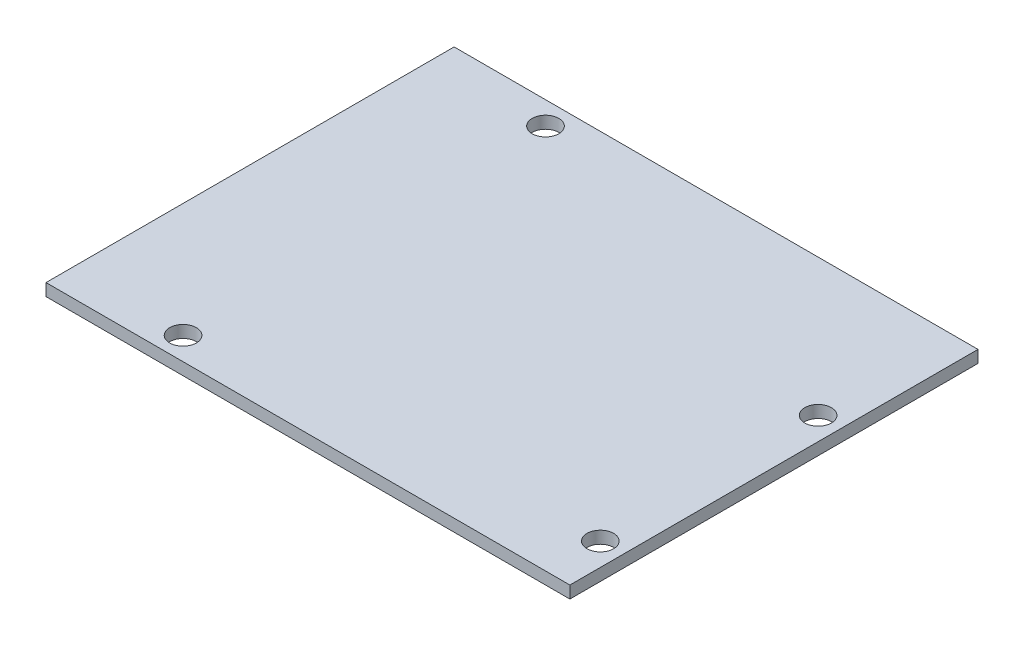
ISO-10303-21;
HEADER;
FILE_DESCRIPTION(('STEP AP214'),'2;1');
FILE_NAME('part.step','',(''),(''),'','','');
FILE_SCHEMA(('AUTOMOTIVE_DESIGN { 1 0 10303 214 1 1 1 1 }'));
ENDSEC;
DATA;
#1=APPLICATION_CONTEXT('core data for automotive mechanical design processes');
#2=APPLICATION_PROTOCOL_DEFINITION('international standard','automotive_design',2000,#1);
#3=PRODUCT_CONTEXT('',#1,'mechanical');
#4=PRODUCT('Part','Part','',(#3));
#5=PRODUCT_RELATED_PRODUCT_CATEGORY('part','',(#4));
#6=PRODUCT_DEFINITION_FORMATION('','',#4);
#7=PRODUCT_DEFINITION_CONTEXT('part definition',#1,'design');
#8=PRODUCT_DEFINITION('design','',#6,#7);
#9=PRODUCT_DEFINITION_SHAPE('','',#8);
#10=(LENGTH_UNIT() NAMED_UNIT(*) SI_UNIT(.MILLI.,.METRE.));
#11=(NAMED_UNIT(*) PLANE_ANGLE_UNIT() SI_UNIT($,.RADIAN.));
#12=(NAMED_UNIT(*) SI_UNIT($,.STERADIAN.) SOLID_ANGLE_UNIT());
#13=UNCERTAINTY_MEASURE_WITH_UNIT(LENGTH_MEASURE(1.E-05),#10,'distance_accuracy_value','');
#14=(GEOMETRIC_REPRESENTATION_CONTEXT(3) GLOBAL_UNCERTAINTY_ASSIGNED_CONTEXT((#13)) GLOBAL_UNIT_ASSIGNED_CONTEXT((#10,
#11,#12)) REPRESENTATION_CONTEXT('',''));
#15=CARTESIAN_POINT('',(0.,0.,0.));
#16=DIRECTION('',(0.,0.,1.));
#17=DIRECTION('',(1.,0.,0.));
#18=AXIS2_PLACEMENT_3D('',#15,#16,#17);
#19=CARTESIAN_POINT('',(-34.4,1.6,26.8));
#20=DIRECTION('',(1.,0.,0.));
#21=DIRECTION('',(0.,0.,-1.));
#22=AXIS2_PLACEMENT_3D('',#19,#20,#21);
#23=PLANE('',#22);
#24=DIRECTION('',(0.,0.,1.));
#25=VECTOR('',#24,1.);
#26=CARTESIAN_POINT('',(-34.4,0.,26.8));
#27=LINE('',#26,#25);
#28=CARTESIAN_POINT('',(-34.4,0.,-26.8));
#29=VERTEX_POINT('',#28);
#30=CARTESIAN_POINT('',(-34.4,0.,26.8));
#31=VERTEX_POINT('',#30);
#32=EDGE_CURVE('E96',#29,#31,#27,.T.);
#33=ORIENTED_EDGE('',*,*,#32,.T.);
#34=DIRECTION('',(0.,-1.,0.));
#35=VECTOR('',#34,1.);
#36=CARTESIAN_POINT('',(-34.4,1.6,26.8));
#37=LINE('',#36,#35);
#38=CARTESIAN_POINT('',(-34.4,1.6,26.8));
#39=VERTEX_POINT('',#38);
#40=EDGE_CURVE('E11',#39,#31,#37,.T.);
#41=ORIENTED_EDGE('',*,*,#40,.F.);
#42=DIRECTION('',(0.,0.,1.));
#43=VECTOR('',#42,1.);
#44=CARTESIAN_POINT('',(-34.4,1.6,26.8));
#45=LINE('',#44,#43);
#46=CARTESIAN_POINT('',(-34.4,1.6,-26.8));
#47=VERTEX_POINT('',#46);
#48=EDGE_CURVE('E84',#47,#39,#45,.T.);
#49=ORIENTED_EDGE('',*,*,#48,.F.);
#50=DIRECTION('',(0.,-1.,0.));
#51=VECTOR('',#50,1.);
#52=CARTESIAN_POINT('',(-34.4,1.6,-26.8));
#53=LINE('',#52,#51);
#54=EDGE_CURVE('E92',#47,#29,#53,.T.);
#55=ORIENTED_EDGE('',*,*,#54,.T.);
#56=EDGE_LOOP('',(#33,#41,#49,#55));
#57=FACE_BOUND('',#56,.T.);
#58=ADVANCED_FACE('F33',(#57),#23,.F.);
#59=CARTESIAN_POINT('',(34.4,1.6,26.8));
#60=DIRECTION('',(0.,0.,-1.));
#61=DIRECTION('',(-1.,0.,0.));
#62=AXIS2_PLACEMENT_3D('',#59,#60,#61);
#63=PLANE('',#62);
#64=DIRECTION('',(1.,0.,0.));
#65=VECTOR('',#64,1.);
#66=CARTESIAN_POINT('',(34.4,0.,26.8));
#67=LINE('',#66,#65);
#68=CARTESIAN_POINT('',(34.4,0.,26.8));
#69=VERTEX_POINT('',#68);
#70=EDGE_CURVE('E88',#31,#69,#67,.T.);
#71=ORIENTED_EDGE('',*,*,#70,.T.);
#72=DIRECTION('',(0.,-1.,0.));
#73=VECTOR('',#72,1.);
#74=CARTESIAN_POINT('',(34.4,1.6,26.8));
#75=LINE('',#74,#73);
#76=CARTESIAN_POINT('',(34.4,1.6,26.8));
#77=VERTEX_POINT('',#76);
#78=EDGE_CURVE('E41',#77,#69,#75,.T.);
#79=ORIENTED_EDGE('',*,*,#78,.F.);
#80=DIRECTION('',(1.,0.,0.));
#81=VECTOR('',#80,1.);
#82=CARTESIAN_POINT('',(34.4,1.6,26.8));
#83=LINE('',#82,#81);
#84=EDGE_CURVE('E79',#39,#77,#83,.T.);
#85=ORIENTED_EDGE('',*,*,#84,.F.);
#86=ORIENTED_EDGE('',*,*,#40,.T.);
#87=EDGE_LOOP('',(#71,#79,#85,#86));
#88=FACE_BOUND('',#87,.T.);
#89=ADVANCED_FACE('F87',(#88),#63,.F.);
#90=CARTESIAN_POINT('',(34.4,1.6,26.8));
#91=DIRECTION('',(-1.,0.,0.));
#92=DIRECTION('',(0.,0.,1.));
#93=AXIS2_PLACEMENT_3D('',#90,#91,#92);
#94=PLANE('',#93);
#95=DIRECTION('',(0.,0.,-1.));
#96=VECTOR('',#95,1.);
#97=CARTESIAN_POINT('',(34.4,0.,26.8));
#98=LINE('',#97,#96);
#99=CARTESIAN_POINT('',(34.4,0.,-26.8));
#100=VERTEX_POINT('',#99);
#101=EDGE_CURVE('E66',#69,#100,#98,.T.);
#102=ORIENTED_EDGE('',*,*,#101,.T.);
#103=DIRECTION('',(0.,-1.,0.));
#104=VECTOR('',#103,1.);
#105=CARTESIAN_POINT('',(34.4,1.6,-26.8));
#106=LINE('',#105,#104);
#107=CARTESIAN_POINT('',(34.4,1.6,-26.8));
#108=VERTEX_POINT('',#107);
#109=EDGE_CURVE('E89',#108,#100,#106,.T.);
#110=ORIENTED_EDGE('',*,*,#109,.F.);
#111=DIRECTION('',(0.,0.,-1.));
#112=VECTOR('',#111,1.);
#113=CARTESIAN_POINT('',(34.4,1.6,26.8));
#114=LINE('',#113,#112);
#115=EDGE_CURVE('E82',#77,#108,#114,.T.);
#116=ORIENTED_EDGE('',*,*,#115,.F.);
#117=ORIENTED_EDGE('',*,*,#78,.T.);
#118=EDGE_LOOP('',(#102,#110,#116,#117));
#119=FACE_BOUND('',#118,.T.);
#120=ADVANCED_FACE('F90',(#119),#94,.F.);
#121=CARTESIAN_POINT('',(34.4,1.6,-26.8));
#122=DIRECTION('',(0.,0.,1.));
#123=DIRECTION('',(1.,0.,0.));
#124=AXIS2_PLACEMENT_3D('',#121,#122,#123);
#125=PLANE('',#124);
#126=DIRECTION('',(-1.,0.,0.));
#127=VECTOR('',#126,1.);
#128=CARTESIAN_POINT('',(34.4,0.,-26.8));
#129=LINE('',#128,#127);
#130=EDGE_CURVE('E72',#100,#29,#129,.T.);
#131=ORIENTED_EDGE('',*,*,#130,.T.);
#132=ORIENTED_EDGE('',*,*,#54,.F.);
#133=DIRECTION('',(-1.,0.,0.));
#134=VECTOR('',#133,1.);
#135=CARTESIAN_POINT('',(34.4,1.6,-26.8));
#136=LINE('',#135,#134);
#137=EDGE_CURVE('E49',#108,#47,#136,.T.);
#138=ORIENTED_EDGE('',*,*,#137,.F.);
#139=ORIENTED_EDGE('',*,*,#109,.T.);
#140=EDGE_LOOP('',(#131,#132,#138,#139));
#141=FACE_BOUND('',#140,.T.);
#142=ADVANCED_FACE('F104',(#141),#125,.F.);
#143=CARTESIAN_POINT('',(-34.4,1.6,-26.8));
#144=DIRECTION('',(0.,1.,0.));
#145=DIRECTION('',(0.,0.,1.));
#146=AXIS2_PLACEMENT_3D('',#143,#144,#145);
#147=PLANE('',#146);
#148=CARTESIAN_POINT('',(31.4,1.6,-8.8));
#149=DIRECTION('',(0.,1.,0.));
#150=DIRECTION('',(0.,0.,1.));
#151=AXIS2_PLACEMENT_3D('',#148,#149,#150);
#152=CIRCLE('',#151,1.75);
#153=CARTESIAN_POINT('',(31.4,1.6,-7.05));
#154=VERTEX_POINT('',#153);
#155=EDGE_CURVE('E130',#154,#154,#152,.T.);
#156=ORIENTED_EDGE('',*,*,#155,.F.);
#157=EDGE_LOOP('',(#156));
#158=FACE_BOUND('',#157,.T.);
#159=CARTESIAN_POINT('',(31.4,1.6,19.8));
#160=DIRECTION('',(0.,1.,0.));
#161=DIRECTION('',(0.,0.,1.));
#162=AXIS2_PLACEMENT_3D('',#159,#160,#161);
#163=CIRCLE('',#162,1.75);
#164=CARTESIAN_POINT('',(31.4,1.6,21.55));
#165=VERTEX_POINT('',#164);
#166=EDGE_CURVE('E124',#165,#165,#163,.T.);
#167=ORIENTED_EDGE('',*,*,#166,.F.);
#168=EDGE_LOOP('',(#167));
#169=FACE_BOUND('',#168,.T.);
#170=CARTESIAN_POINT('',(-19.4,1.6,23.8));
#171=DIRECTION('',(0.,1.,0.));
#172=DIRECTION('',(0.,0.,1.));
#173=AXIS2_PLACEMENT_3D('',#170,#171,#172);
#174=CIRCLE('',#173,1.75);
#175=CARTESIAN_POINT('',(-19.4,1.6,25.55));
#176=VERTEX_POINT('',#175);
#177=EDGE_CURVE('E118',#176,#176,#174,.T.);
#178=ORIENTED_EDGE('',*,*,#177,.F.);
#179=EDGE_LOOP('',(#178));
#180=FACE_BOUND('',#179,.T.);
#181=CARTESIAN_POINT('',(-19.4,1.6,-23.8));
#182=DIRECTION('',(0.,1.,0.));
#183=DIRECTION('',(0.,0.,1.));
#184=AXIS2_PLACEMENT_3D('',#181,#182,#183);
#185=CIRCLE('',#184,1.75);
#186=CARTESIAN_POINT('',(-19.4,1.6,-22.05));
#187=VERTEX_POINT('',#186);
#188=EDGE_CURVE('E112',#187,#187,#185,.T.);
#189=ORIENTED_EDGE('',*,*,#188,.F.);
#190=EDGE_LOOP('',(#189));
#191=FACE_BOUND('',#190,.T.);
#192=ORIENTED_EDGE('',*,*,#48,.T.);
#193=ORIENTED_EDGE('',*,*,#84,.T.);
#194=ORIENTED_EDGE('',*,*,#115,.T.);
#195=ORIENTED_EDGE('',*,*,#137,.T.);
#196=EDGE_LOOP('',(#192,#193,#194,#195));
#197=FACE_BOUND('',#196,.T.);
#198=ADVANCED_FACE('F80',(#158,#169,#180,#191,#197),#147,.T.);
#199=CARTESIAN_POINT('',(-34.4,0.,-26.8));
#200=DIRECTION('',(0.,1.,0.));
#201=DIRECTION('',(0.,0.,1.));
#202=AXIS2_PLACEMENT_3D('',#199,#200,#201);
#203=PLANE('',#202);
#204=CARTESIAN_POINT('',(31.4,0.,-8.8));
#205=DIRECTION('',(0.,1.,0.));
#206=DIRECTION('',(0.,0.,1.));
#207=AXIS2_PLACEMENT_3D('',#204,#205,#206);
#208=CIRCLE('',#207,1.75);
#209=CARTESIAN_POINT('',(31.4,0.,-7.05));
#210=VERTEX_POINT('',#209);
#211=EDGE_CURVE('E127',#210,#210,#208,.F.);
#212=ORIENTED_EDGE('',*,*,#211,.F.);
#213=EDGE_LOOP('',(#212));
#214=FACE_BOUND('',#213,.T.);
#215=CARTESIAN_POINT('',(31.4,0.,19.8));
#216=DIRECTION('',(0.,1.,0.));
#217=DIRECTION('',(0.,0.,1.));
#218=AXIS2_PLACEMENT_3D('',#215,#216,#217);
#219=CIRCLE('',#218,1.75);
#220=CARTESIAN_POINT('',(31.4,0.,21.55));
#221=VERTEX_POINT('',#220);
#222=EDGE_CURVE('E121',#221,#221,#219,.F.);
#223=ORIENTED_EDGE('',*,*,#222,.F.);
#224=EDGE_LOOP('',(#223));
#225=FACE_BOUND('',#224,.T.);
#226=CARTESIAN_POINT('',(-19.4,0.,23.8));
#227=DIRECTION('',(0.,1.,0.));
#228=DIRECTION('',(0.,0.,1.));
#229=AXIS2_PLACEMENT_3D('',#226,#227,#228);
#230=CIRCLE('',#229,1.75);
#231=CARTESIAN_POINT('',(-19.4,0.,25.55));
#232=VERTEX_POINT('',#231);
#233=EDGE_CURVE('E115',#232,#232,#230,.F.);
#234=ORIENTED_EDGE('',*,*,#233,.F.);
#235=EDGE_LOOP('',(#234));
#236=FACE_BOUND('',#235,.T.);
#237=CARTESIAN_POINT('',(-19.4,0.,-23.8));
#238=DIRECTION('',(0.,1.,0.));
#239=DIRECTION('',(0.,0.,1.));
#240=AXIS2_PLACEMENT_3D('',#237,#238,#239);
#241=CIRCLE('',#240,1.75);
#242=CARTESIAN_POINT('',(-19.4,0.,-22.05));
#243=VERTEX_POINT('',#242);
#244=EDGE_CURVE('E99',#243,#243,#241,.F.);
#245=ORIENTED_EDGE('',*,*,#244,.F.);
#246=EDGE_LOOP('',(#245));
#247=FACE_BOUND('',#246,.T.);
#248=ORIENTED_EDGE('',*,*,#32,.F.);
#249=ORIENTED_EDGE('',*,*,#130,.F.);
#250=ORIENTED_EDGE('',*,*,#101,.F.);
#251=ORIENTED_EDGE('',*,*,#70,.F.);
#252=EDGE_LOOP('',(#248,#249,#250,#251));
#253=FACE_BOUND('',#252,.T.);
#254=ADVANCED_FACE('F107',(#214,#225,#236,#247,#253),#203,.F.);
#255=CARTESIAN_POINT('',(-19.4,-0.000999999999999916,-23.8));
#256=DIRECTION('',(0.,1.,0.));
#257=DIRECTION('',(0.,0.,1.));
#258=AXIS2_PLACEMENT_3D('',#255,#256,#257);
#259=CYLINDRICAL_SURFACE('',#258,1.75);
#260=ORIENTED_EDGE('',*,*,#188,.T.);
#261=EDGE_LOOP('',(#260));
#262=FACE_BOUND('',#261,.T.);
#263=ORIENTED_EDGE('',*,*,#244,.T.);
#264=EDGE_LOOP('',(#263));
#265=FACE_BOUND('',#264,.T.);
#266=ADVANCED_FACE('F146',(#262,#265),#259,.F.);
#267=CARTESIAN_POINT('',(-19.4,-0.000999999999999916,23.8));
#268=DIRECTION('',(0.,1.,0.));
#269=DIRECTION('',(0.,0.,1.));
#270=AXIS2_PLACEMENT_3D('',#267,#268,#269);
#271=CYLINDRICAL_SURFACE('',#270,1.75);
#272=ORIENTED_EDGE('',*,*,#177,.T.);
#273=EDGE_LOOP('',(#272));
#274=FACE_BOUND('',#273,.T.);
#275=ORIENTED_EDGE('',*,*,#233,.T.);
#276=EDGE_LOOP('',(#275));
#277=FACE_BOUND('',#276,.T.);
#278=ADVANCED_FACE('F149',(#274,#277),#271,.F.);
#279=CARTESIAN_POINT('',(31.4,-0.000999999999999916,19.8));
#280=DIRECTION('',(0.,1.,0.));
#281=DIRECTION('',(0.,0.,1.));
#282=AXIS2_PLACEMENT_3D('',#279,#280,#281);
#283=CYLINDRICAL_SURFACE('',#282,1.75);
#284=ORIENTED_EDGE('',*,*,#166,.T.);
#285=EDGE_LOOP('',(#284));
#286=FACE_BOUND('',#285,.T.);
#287=ORIENTED_EDGE('',*,*,#222,.T.);
#288=EDGE_LOOP('',(#287));
#289=FACE_BOUND('',#288,.T.);
#290=ADVANCED_FACE('F194',(#286,#289),#283,.F.);
#291=CARTESIAN_POINT('',(31.4,-0.000999999999999916,-8.8));
#292=DIRECTION('',(0.,1.,0.));
#293=DIRECTION('',(0.,0.,1.));
#294=AXIS2_PLACEMENT_3D('',#291,#292,#293);
#295=CYLINDRICAL_SURFACE('',#294,1.75);
#296=ORIENTED_EDGE('',*,*,#155,.T.);
#297=EDGE_LOOP('',(#296));
#298=FACE_BOUND('',#297,.T.);
#299=ORIENTED_EDGE('',*,*,#211,.T.);
#300=EDGE_LOOP('',(#299));
#301=FACE_BOUND('',#300,.T.);
#302=ADVANCED_FACE('F134',(#298,#301),#295,.F.);
#303=CLOSED_SHELL('',(#58,#89,#120,#142,#198,#254,#266,#278,#290,#302));
#304=MANIFOLD_SOLID_BREP('B2',#303);
#305=ADVANCED_BREP_SHAPE_REPRESENTATION('',(#18,#304),#14);
#306=SHAPE_DEFINITION_REPRESENTATION(#9,#305);
ENDSEC;
END-ISO-10303-21;
